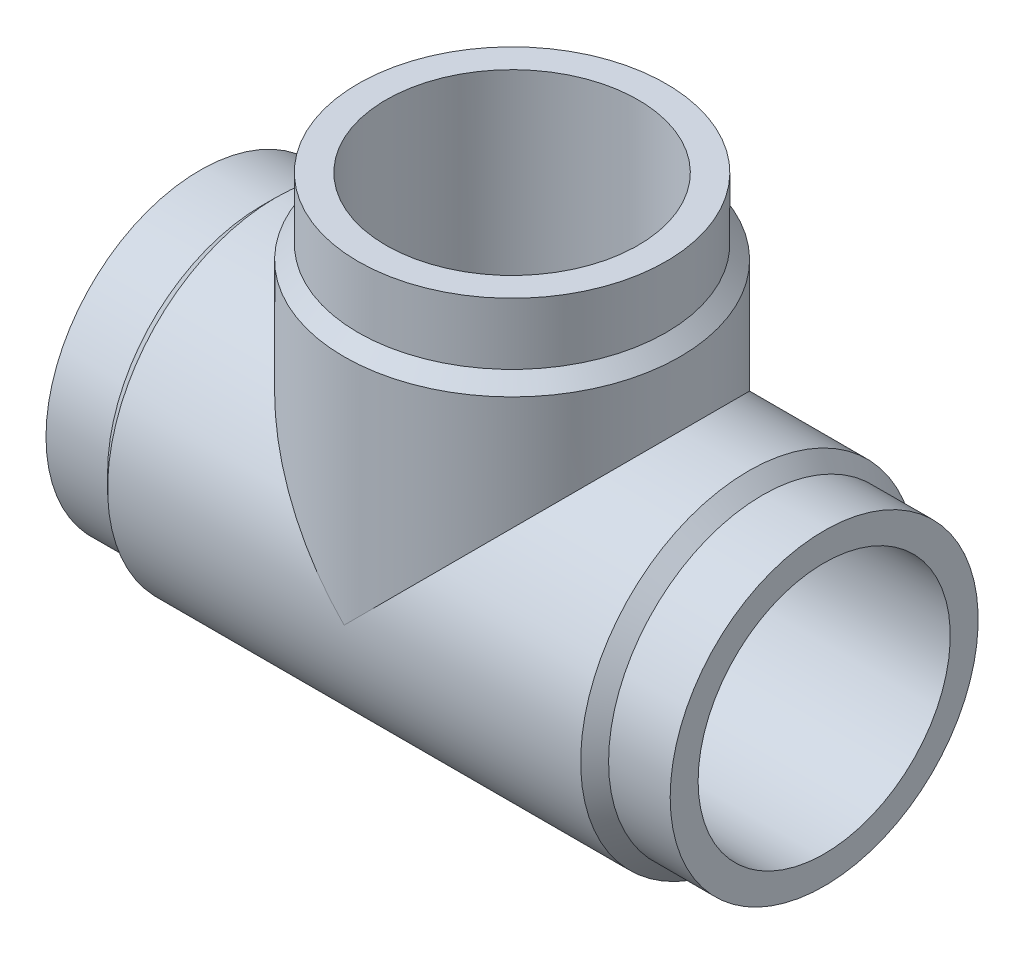
ISO-10303-21;
HEADER;
FILE_DESCRIPTION(('STEP AP214'),'2;1');
FILE_NAME('part.step','',(''),(''),'','','');
FILE_SCHEMA(('AUTOMOTIVE_DESIGN { 1 0 10303 214 1 1 1 1 }'));
ENDSEC;
DATA;
#1=APPLICATION_CONTEXT('core data for automotive mechanical design processes');
#2=APPLICATION_PROTOCOL_DEFINITION('international standard','automotive_design',2000,#1);
#3=PRODUCT_CONTEXT('',#1,'mechanical');
#4=PRODUCT('Part','Part','',(#3));
#5=PRODUCT_RELATED_PRODUCT_CATEGORY('part','',(#4));
#6=PRODUCT_DEFINITION_FORMATION('','',#4);
#7=PRODUCT_DEFINITION_CONTEXT('part definition',#1,'design');
#8=PRODUCT_DEFINITION('design','',#6,#7);
#9=PRODUCT_DEFINITION_SHAPE('','',#8);
#10=(LENGTH_UNIT() NAMED_UNIT(*) SI_UNIT(.MILLI.,.METRE.));
#11=(NAMED_UNIT(*) PLANE_ANGLE_UNIT() SI_UNIT($,.RADIAN.));
#12=(NAMED_UNIT(*) SI_UNIT($,.STERADIAN.) SOLID_ANGLE_UNIT());
#13=UNCERTAINTY_MEASURE_WITH_UNIT(LENGTH_MEASURE(1.E-05),#10,'distance_accuracy_value','');
#14=(GEOMETRIC_REPRESENTATION_CONTEXT(3) GLOBAL_UNCERTAINTY_ASSIGNED_CONTEXT((#13)) GLOBAL_UNIT_ASSIGNED_CONTEXT((#10,
#11,#12)) REPRESENTATION_CONTEXT('',''));
#15=CARTESIAN_POINT('',(0.,0.,0.));
#16=DIRECTION('',(0.,0.,1.));
#17=DIRECTION('',(1.,0.,0.));
#18=AXIS2_PLACEMENT_3D('',#15,#16,#17);
#19=CARTESIAN_POINT('',(-76.,75.,0.));
#20=DIRECTION('',(0.,1.,0.));
#21=DIRECTION('',(0.,0.,1.));
#22=AXIS2_PLACEMENT_3D('',#19,#20,#21);
#23=CYLINDRICAL_SURFACE('',#22,37.5);
#24=CARTESIAN_POINT('',(-76.,75.,0.));
#25=DIRECTION('',(0.,1.,0.));
#26=DIRECTION('',(0.,0.,1.));
#27=AXIS2_PLACEMENT_3D('',#24,#25,#26);
#28=CIRCLE('',#27,37.5);
#29=CARTESIAN_POINT('',(-76.,75.,37.5));
#30=VERTEX_POINT('',#29);
#31=EDGE_CURVE('E18',#30,#30,#28,.T.);
#32=ORIENTED_EDGE('',*,*,#31,.F.);
#33=EDGE_LOOP('',(#32));
#34=FACE_BOUND('',#33,.T.);
#35=CARTESIAN_POINT('',(-76.,60.,0.));
#36=DIRECTION('',(0.,1.,0.));
#37=DIRECTION('',(1.,0.,0.));
#38=AXIS2_PLACEMENT_3D('',#35,#36,#37);
#39=CIRCLE('',#38,37.5);
#40=CARTESIAN_POINT('',(-38.5,60.,0.));
#41=VERTEX_POINT('',#40);
#42=EDGE_CURVE('E71',#41,#41,#39,.F.);
#43=ORIENTED_EDGE('',*,*,#42,.F.);
#44=EDGE_LOOP('',(#43));
#45=FACE_BOUND('',#44,.T.);
#46=ADVANCED_FACE('F15',(#34,#45),#23,.T.);
#47=CARTESIAN_POINT('',(-76.,60.,0.));
#48=DIRECTION('',(0.,-1.,0.));
#49=DIRECTION('',(0.,0.,-1.));
#50=AXIS2_PLACEMENT_3D('',#47,#48,#49);
#51=CONICAL_SURFACE('',#50,37.5,0.785398163397443);
#52=CARTESIAN_POINT('',(-76.,56.6,0.));
#53=DIRECTION('',(0.,1.,0.));
#54=DIRECTION('',(1.,0.,0.));
#55=AXIS2_PLACEMENT_3D('',#52,#53,#54);
#56=CIRCLE('',#55,40.9);
#57=CARTESIAN_POINT('',(-35.1,56.6,0.));
#58=VERTEX_POINT('',#57);
#59=EDGE_CURVE('E60',#58,#58,#56,.F.);
#60=ORIENTED_EDGE('',*,*,#59,.F.);
#61=EDGE_LOOP('',(#60));
#62=FACE_BOUND('',#61,.T.);
#63=ORIENTED_EDGE('',*,*,#42,.T.);
#64=EDGE_LOOP('',(#63));
#65=FACE_BOUND('',#64,.T.);
#66=ADVANCED_FACE('F141',(#62,#65),#51,.T.);
#67=CARTESIAN_POINT('',(-15.,0.,0.));
#68=DIRECTION('',(-1.,0.,0.));
#69=DIRECTION('',(0.,0.,1.));
#70=AXIS2_PLACEMENT_3D('',#67,#68,#69);
#71=CYLINDRICAL_SURFACE('',#70,37.5);
#72=CARTESIAN_POINT('',(-15.,0.,0.));
#73=DIRECTION('',(1.,0.,0.));
#74=DIRECTION('',(0.,1.,0.));
#75=AXIS2_PLACEMENT_3D('',#72,#73,#74);
#76=CIRCLE('',#75,37.5);
#77=CARTESIAN_POINT('',(-15.,37.5,0.));
#78=VERTEX_POINT('',#77);
#79=EDGE_CURVE('E64',#78,#78,#76,.F.);
#80=ORIENTED_EDGE('',*,*,#79,.F.);
#81=EDGE_LOOP('',(#80));
#82=FACE_BOUND('',#81,.T.);
#83=CARTESIAN_POINT('',(0.,0.,0.));
#84=DIRECTION('',(-1.,0.,0.));
#85=DIRECTION('',(0.,0.,1.));
#86=AXIS2_PLACEMENT_3D('',#83,#84,#85);
#87=CIRCLE('',#86,37.5);
#88=CARTESIAN_POINT('',(0.,0.,37.5));
#89=VERTEX_POINT('',#88);
#90=EDGE_CURVE('E58',#89,#89,#87,.F.);
#91=ORIENTED_EDGE('',*,*,#90,.F.);
#92=EDGE_LOOP('',(#91));
#93=FACE_BOUND('',#92,.T.);
#94=ADVANCED_FACE('F136',(#82,#93),#71,.T.);
#95=CARTESIAN_POINT('',(-113.5,75.,37.9500021082349));
#96=DIRECTION('',(0.,1.,0.));
#97=DIRECTION('',(1.,0.,0.));
#98=AXIS2_PLACEMENT_3D('',#95,#96,#97);
#99=PLANE('',#98);
#100=CARTESIAN_POINT('',(-76.,75.,0.));
#101=DIRECTION('',(0.,1.,0.));
#102=DIRECTION('',(0.,0.,1.));
#103=AXIS2_PLACEMENT_3D('',#100,#101,#102);
#104=CIRCLE('',#103,30.7);
#105=CARTESIAN_POINT('',(-76.,75.,30.7));
#106=VERTEX_POINT('',#105);
#107=EDGE_CURVE('E52',#106,#106,#104,.T.);
#108=ORIENTED_EDGE('',*,*,#107,.F.);
#109=EDGE_LOOP('',(#108));
#110=FACE_BOUND('',#109,.T.);
#111=ORIENTED_EDGE('',*,*,#31,.T.);
#112=EDGE_LOOP('',(#111));
#113=FACE_BOUND('',#112,.T.);
#114=ADVANCED_FACE('F130',(#110,#113),#99,.T.);
#115=CARTESIAN_POINT('',(-15.,0.,0.));
#116=DIRECTION('',(-1.,0.,0.));
#117=DIRECTION('',(0.,0.,1.));
#118=AXIS2_PLACEMENT_3D('',#115,#116,#117);
#119=CONICAL_SURFACE('',#118,37.5,0.785398163397444);
#120=ORIENTED_EDGE('',*,*,#79,.T.);
#121=EDGE_LOOP('',(#120));
#122=FACE_BOUND('',#121,.T.);
#123=CARTESIAN_POINT('',(-18.4,0.,0.));
#124=DIRECTION('',(-1.,0.,0.));
#125=DIRECTION('',(0.,1.,0.));
#126=AXIS2_PLACEMENT_3D('',#123,#124,#125);
#127=CIRCLE('',#126,40.9);
#128=CARTESIAN_POINT('',(-18.4,40.9,0.));
#129=VERTEX_POINT('',#128);
#130=EDGE_CURVE('E49',#129,#129,#127,.T.);
#131=ORIENTED_EDGE('',*,*,#130,.F.);
#132=EDGE_LOOP('',(#131));
#133=FACE_BOUND('',#132,.T.);
#134=ADVANCED_FACE('F95',(#122,#133),#119,.T.);
#135=CARTESIAN_POINT('',(-76.,56.6,0.));
#136=DIRECTION('',(0.,1.,0.));
#137=DIRECTION('',(0.,0.,1.));
#138=AXIS2_PLACEMENT_3D('',#135,#136,#137);
#139=CYLINDRICAL_SURFACE('',#138,40.9);
#140=CARTESIAN_POINT('',(-76.,0.,0.));
#141=DIRECTION('',(0.707106781186547,0.707106781186547,0.));
#142=DIRECTION('',(-0.707106781186547,0.707106781186547,0.));
#143=AXIS2_PLACEMENT_3D('',#140,#141,#142);
#144=ELLIPSE('',#143,57.8413347010596,40.9);
#145=CARTESIAN_POINT('',(-76.,0.,40.9));
#146=VERTEX_POINT('',#145);
#147=CARTESIAN_POINT('',(-76.,0.,-40.9));
#148=VERTEX_POINT('',#147);
#149=EDGE_CURVE('E44',#146,#148,#144,.F.);
#150=ORIENTED_EDGE('',*,*,#149,.F.);
#151=CARTESIAN_POINT('',(-76.,0.,0.));
#152=DIRECTION('',(-0.707106781186547,0.707106781186547,0.));
#153=DIRECTION('',(-0.707106781186547,-0.707106781186547,0.));
#154=AXIS2_PLACEMENT_3D('',#151,#152,#153);
#155=ELLIPSE('',#154,57.8413347010596,40.9);
#156=EDGE_CURVE('E40',#148,#146,#155,.F.);
#157=ORIENTED_EDGE('',*,*,#156,.F.);
#158=EDGE_LOOP('',(#150,#157));
#159=FACE_BOUND('',#158,.T.);
#160=ORIENTED_EDGE('',*,*,#59,.T.);
#161=EDGE_LOOP('',(#160));
#162=FACE_BOUND('',#161,.T.);
#163=ADVANCED_FACE('F47',(#159,#162),#139,.T.);
#164=CARTESIAN_POINT('',(0.,37.5,37.9500021082962));
#165=DIRECTION('',(1.,0.,0.));
#166=DIRECTION('',(0.,-1.,0.));
#167=AXIS2_PLACEMENT_3D('',#164,#165,#166);
#168=PLANE('',#167);
#169=CARTESIAN_POINT('',(0.,0.,0.));
#170=DIRECTION('',(-1.,0.,0.));
#171=DIRECTION('',(0.,0.,1.));
#172=AXIS2_PLACEMENT_3D('',#169,#170,#171);
#173=CIRCLE('',#172,30.7);
#174=CARTESIAN_POINT('',(0.,0.,30.7));
#175=VERTEX_POINT('',#174);
#176=EDGE_CURVE('E45',#175,#175,#173,.F.);
#177=ORIENTED_EDGE('',*,*,#176,.F.);
#178=EDGE_LOOP('',(#177));
#179=FACE_BOUND('',#178,.T.);
#180=ORIENTED_EDGE('',*,*,#90,.T.);
#181=EDGE_LOOP('',(#180));
#182=FACE_BOUND('',#181,.T.);
#183=ADVANCED_FACE('F85',(#179,#182),#168,.T.);
#184=CARTESIAN_POINT('',(-76.,0.,0.));
#185=DIRECTION('',(0.,1.,0.));
#186=DIRECTION('',(0.,0.,1.));
#187=AXIS2_PLACEMENT_3D('',#184,#185,#186);
#188=CYLINDRICAL_SURFACE('',#187,30.7);
#189=CARTESIAN_POINT('',(-76.,0.,0.));
#190=DIRECTION('',(-0.707106781186547,-0.707106781186547,0.));
#191=DIRECTION('',(-0.707106781186547,0.707106781186547,0.));
#192=AXIS2_PLACEMENT_3D('',#189,#190,#191);
#193=ELLIPSE('',#192,43.416356364854,30.7);
#194=CARTESIAN_POINT('',(-76.,0.,-30.7));
#195=VERTEX_POINT('',#194);
#196=CARTESIAN_POINT('',(-76.,0.,30.7));
#197=VERTEX_POINT('',#196);
#198=EDGE_CURVE('E78',#195,#197,#193,.F.);
#199=ORIENTED_EDGE('',*,*,#198,.F.);
#200=CARTESIAN_POINT('',(-76.,0.,0.));
#201=DIRECTION('',(-0.707106781186547,0.707106781186547,0.));
#202=DIRECTION('',(0.707106781186547,0.707106781186547,0.));
#203=AXIS2_PLACEMENT_3D('',#200,#201,#202);
#204=ELLIPSE('',#203,43.416356364854,30.7);
#205=EDGE_CURVE('E32',#195,#197,#204,.F.);
#206=ORIENTED_EDGE('',*,*,#205,.T.);
#207=EDGE_LOOP('',(#199,#206));
#208=FACE_BOUND('',#207,.T.);
#209=ORIENTED_EDGE('',*,*,#107,.T.);
#210=EDGE_LOOP('',(#209));
#211=FACE_BOUND('',#210,.T.);
#212=ADVANCED_FACE('F87',(#208,#211),#188,.F.);
#213=CARTESIAN_POINT('',(-133.6,0.,0.));
#214=DIRECTION('',(-1.,0.,0.));
#215=DIRECTION('',(0.,0.,1.));
#216=AXIS2_PLACEMENT_3D('',#213,#214,#215);
#217=CYLINDRICAL_SURFACE('',#216,40.9);
#218=ORIENTED_EDGE('',*,*,#130,.T.);
#219=EDGE_LOOP('',(#218));
#220=FACE_BOUND('',#219,.T.);
#221=CARTESIAN_POINT('',(-133.6,0.,0.));
#222=DIRECTION('',(-1.,0.,0.));
#223=DIRECTION('',(0.,1.,0.));
#224=AXIS2_PLACEMENT_3D('',#221,#222,#223);
#225=CIRCLE('',#224,40.9);
#226=CARTESIAN_POINT('',(-133.6,40.9,0.));
#227=VERTEX_POINT('',#226);
#228=EDGE_CURVE('E77',#227,#227,#225,.T.);
#229=ORIENTED_EDGE('',*,*,#228,.F.);
#230=EDGE_LOOP('',(#229));
#231=FACE_BOUND('',#230,.T.);
#232=ORIENTED_EDGE('',*,*,#149,.T.);
#233=ORIENTED_EDGE('',*,*,#156,.T.);
#234=EDGE_LOOP('',(#232,#233));
#235=FACE_BOUND('',#234,.T.);
#236=ADVANCED_FACE('F43',(#220,#231,#235),#217,.T.);
#237=CARTESIAN_POINT('',(-76.,0.,0.));
#238=DIRECTION('',(-1.,0.,0.));
#239=DIRECTION('',(0.,0.,1.));
#240=AXIS2_PLACEMENT_3D('',#237,#238,#239);
#241=CYLINDRICAL_SURFACE('',#240,30.7);
#242=ORIENTED_EDGE('',*,*,#205,.F.);
#243=ORIENTED_EDGE('',*,*,#198,.T.);
#244=EDGE_LOOP('',(#242,#243));
#245=FACE_BOUND('',#244,.T.);
#246=ORIENTED_EDGE('',*,*,#176,.T.);
#247=EDGE_LOOP('',(#246));
#248=FACE_BOUND('',#247,.T.);
#249=CARTESIAN_POINT('',(-152.,0.,0.));
#250=DIRECTION('',(-1.,0.,0.));
#251=DIRECTION('',(0.,0.,1.));
#252=AXIS2_PLACEMENT_3D('',#249,#250,#251);
#253=CIRCLE('',#252,30.7);
#254=CARTESIAN_POINT('',(-152.,0.,30.7));
#255=VERTEX_POINT('',#254);
#256=EDGE_CURVE('E74',#255,#255,#253,.F.);
#257=ORIENTED_EDGE('',*,*,#256,.F.);
#258=EDGE_LOOP('',(#257));
#259=FACE_BOUND('',#258,.T.);
#260=ADVANCED_FACE('F82',(#245,#248,#259),#241,.F.);
#261=CARTESIAN_POINT('',(-137.,0.,0.));
#262=DIRECTION('',(1.,0.,0.));
#263=DIRECTION('',(0.,0.,-1.));
#264=AXIS2_PLACEMENT_3D('',#261,#262,#263);
#265=CONICAL_SURFACE('',#264,37.5,0.785398163397442);
#266=ORIENTED_EDGE('',*,*,#228,.T.);
#267=EDGE_LOOP('',(#266));
#268=FACE_BOUND('',#267,.T.);
#269=CARTESIAN_POINT('',(-137.,0.,0.));
#270=DIRECTION('',(-1.,0.,0.));
#271=DIRECTION('',(0.,1.,0.));
#272=AXIS2_PLACEMENT_3D('',#269,#270,#271);
#273=CIRCLE('',#272,37.5);
#274=CARTESIAN_POINT('',(-137.,37.5,0.));
#275=VERTEX_POINT('',#274);
#276=EDGE_CURVE('E24',#275,#275,#273,.T.);
#277=ORIENTED_EDGE('',*,*,#276,.F.);
#278=EDGE_LOOP('',(#277));
#279=FACE_BOUND('',#278,.T.);
#280=ADVANCED_FACE('F105',(#268,#279),#265,.T.);
#281=CARTESIAN_POINT('',(-152.,-37.5,37.9500021082962));
#282=DIRECTION('',(-1.,0.,0.));
#283=DIRECTION('',(0.,1.,0.));
#284=AXIS2_PLACEMENT_3D('',#281,#282,#283);
#285=PLANE('',#284);
#286=ORIENTED_EDGE('',*,*,#256,.T.);
#287=EDGE_LOOP('',(#286));
#288=FACE_BOUND('',#287,.T.);
#289=CARTESIAN_POINT('',(-152.,0.,0.));
#290=DIRECTION('',(-1.,0.,0.));
#291=DIRECTION('',(0.,0.,1.));
#292=AXIS2_PLACEMENT_3D('',#289,#290,#291);
#293=CIRCLE('',#292,37.5);
#294=CARTESIAN_POINT('',(-152.,0.,37.5));
#295=VERTEX_POINT('',#294);
#296=EDGE_CURVE('E9',#295,#295,#293,.F.);
#297=ORIENTED_EDGE('',*,*,#296,.F.);
#298=EDGE_LOOP('',(#297));
#299=FACE_BOUND('',#298,.T.);
#300=ADVANCED_FACE('F99',(#288,#299),#285,.T.);
#301=CARTESIAN_POINT('',(-152.,0.,0.));
#302=DIRECTION('',(-1.,0.,0.));
#303=DIRECTION('',(0.,0.,1.));
#304=AXIS2_PLACEMENT_3D('',#301,#302,#303);
#305=CYLINDRICAL_SURFACE('',#304,37.5);
#306=ORIENTED_EDGE('',*,*,#276,.T.);
#307=EDGE_LOOP('',(#306));
#308=FACE_BOUND('',#307,.T.);
#309=ORIENTED_EDGE('',*,*,#296,.T.);
#310=EDGE_LOOP('',(#309));
#311=FACE_BOUND('',#310,.T.);
#312=ADVANCED_FACE('F97',(#308,#311),#305,.T.);
#313=CLOSED_SHELL('',(#46,#66,#94,#114,#134,#163,#183,#212,#236,#260,#280,#300,#312));
#314=MANIFOLD_SOLID_BREP('B1',#313);
#315=ADVANCED_BREP_SHAPE_REPRESENTATION('',(#18,#314),#14);
#316=SHAPE_DEFINITION_REPRESENTATION(#9,#315);
ENDSEC;
END-ISO-10303-21;
